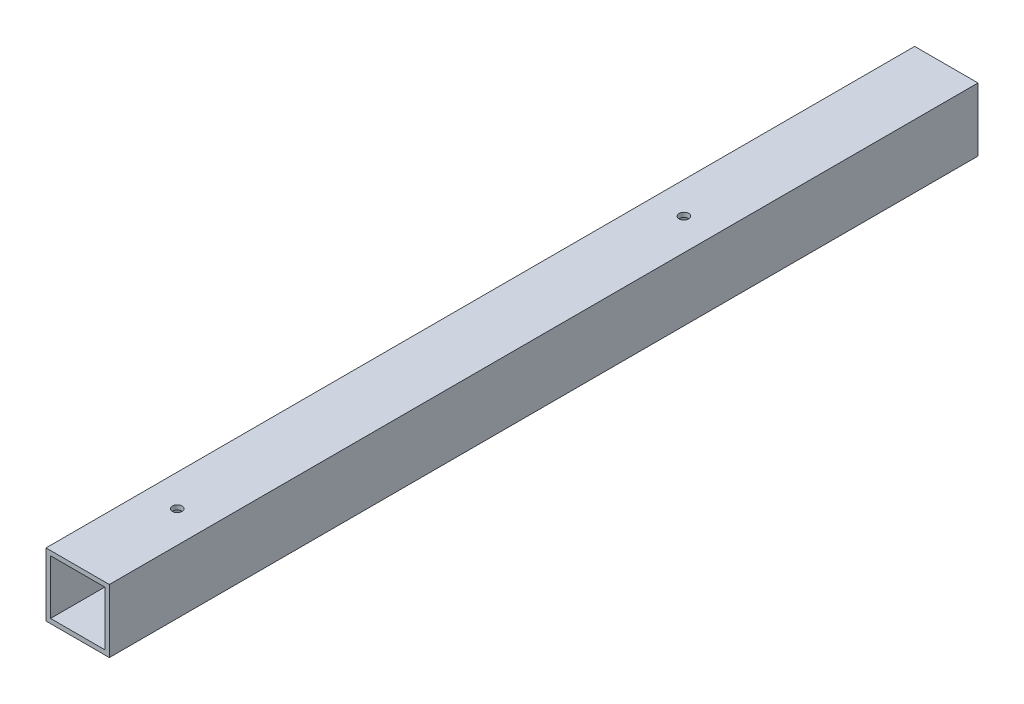
ISO-10303-21;
HEADER;
FILE_DESCRIPTION(('STEP AP214'),'2;1');
FILE_NAME('part.step','',(''),(''),'','','');
FILE_SCHEMA(('AUTOMOTIVE_DESIGN { 1 0 10303 214 1 1 1 1 }'));
ENDSEC;
DATA;
#1=APPLICATION_CONTEXT('core data for automotive mechanical design processes');
#2=APPLICATION_PROTOCOL_DEFINITION('international standard','automotive_design',2000,#1);
#3=PRODUCT_CONTEXT('',#1,'mechanical');
#4=PRODUCT('Part','Part','',(#3));
#5=PRODUCT_RELATED_PRODUCT_CATEGORY('part','',(#4));
#6=PRODUCT_DEFINITION_FORMATION('','',#4);
#7=PRODUCT_DEFINITION_CONTEXT('part definition',#1,'design');
#8=PRODUCT_DEFINITION('design','',#6,#7);
#9=PRODUCT_DEFINITION_SHAPE('','',#8);
#10=(LENGTH_UNIT() NAMED_UNIT(*) SI_UNIT(.MILLI.,.METRE.));
#11=(NAMED_UNIT(*) PLANE_ANGLE_UNIT() SI_UNIT($,.RADIAN.));
#12=(NAMED_UNIT(*) SI_UNIT($,.STERADIAN.) SOLID_ANGLE_UNIT());
#13=UNCERTAINTY_MEASURE_WITH_UNIT(LENGTH_MEASURE(1.E-05),#10,'distance_accuracy_value','');
#14=(GEOMETRIC_REPRESENTATION_CONTEXT(3) GLOBAL_UNCERTAINTY_ASSIGNED_CONTEXT((#13)) GLOBAL_UNIT_ASSIGNED_CONTEXT((#10,
#11,#12)) REPRESENTATION_CONTEXT('',''));
#15=CARTESIAN_POINT('',(0.,0.,0.));
#16=DIRECTION('',(0.,0.,1.));
#17=DIRECTION('',(1.,0.,0.));
#18=AXIS2_PLACEMENT_3D('',#15,#16,#17);
#19=CARTESIAN_POINT('',(0.,0.,609.6));
#20=DIRECTION('',(0.,0.,-1.));
#21=DIRECTION('',(-1.,0.,0.));
#22=AXIS2_PLACEMENT_3D('',#19,#20,#21);
#23=PLANE('',#22);
#24=DIRECTION('',(0.,-1.,0.));
#25=VECTOR('',#24,1.);
#26=CARTESIAN_POINT('',(0.,0.,609.6));
#27=LINE('',#26,#25);
#28=CARTESIAN_POINT('',(0.,44.45,609.6));
#29=VERTEX_POINT('',#28);
#30=CARTESIAN_POINT('',(0.,0.,609.6));
#31=VERTEX_POINT('',#30);
#32=EDGE_CURVE('E139',#29,#31,#27,.T.);
#33=ORIENTED_EDGE('',*,*,#32,.T.);
#34=DIRECTION('',(1.,0.,0.));
#35=VECTOR('',#34,1.);
#36=CARTESIAN_POINT('',(0.,0.,609.6));
#37=LINE('',#36,#35);
#38=CARTESIAN_POINT('',(44.45,0.,609.6));
#39=VERTEX_POINT('',#38);
#40=EDGE_CURVE('E142',#31,#39,#37,.T.);
#41=ORIENTED_EDGE('',*,*,#40,.T.);
#42=DIRECTION('',(0.,1.,0.));
#43=VECTOR('',#42,1.);
#44=CARTESIAN_POINT('',(44.45,0.,609.6));
#45=LINE('',#44,#43);
#46=CARTESIAN_POINT('',(44.45,44.45,609.6));
#47=VERTEX_POINT('',#46);
#48=EDGE_CURVE('E145',#39,#47,#45,.T.);
#49=ORIENTED_EDGE('',*,*,#48,.T.);
#50=DIRECTION('',(-1.,0.,0.));
#51=VECTOR('',#50,1.);
#52=CARTESIAN_POINT('',(0.,44.45,609.6));
#53=LINE('',#52,#51);
#54=EDGE_CURVE('E147',#47,#29,#53,.T.);
#55=ORIENTED_EDGE('',*,*,#54,.T.);
#56=EDGE_LOOP('',(#33,#41,#49,#55));
#57=FACE_BOUND('',#56,.T.);
#58=DIRECTION('',(1.,0.,0.));
#59=VECTOR('',#58,1.);
#60=CARTESIAN_POINT('',(3.175,3.175,609.6));
#61=LINE('',#60,#59);
#62=CARTESIAN_POINT('',(3.175,3.175,609.6));
#63=VERTEX_POINT('',#62);
#64=CARTESIAN_POINT('',(41.275,3.175,609.6));
#65=VERTEX_POINT('',#64);
#66=EDGE_CURVE('E101',#63,#65,#61,.T.);
#67=ORIENTED_EDGE('',*,*,#66,.F.);
#68=DIRECTION('',(0.,-1.,0.));
#69=VECTOR('',#68,1.);
#70=CARTESIAN_POINT('',(3.175,3.175,609.6));
#71=LINE('',#70,#69);
#72=CARTESIAN_POINT('',(3.175,41.275,609.6));
#73=VERTEX_POINT('',#72);
#74=EDGE_CURVE('E123',#73,#63,#71,.T.);
#75=ORIENTED_EDGE('',*,*,#74,.F.);
#76=DIRECTION('',(-1.,0.,0.));
#77=VECTOR('',#76,1.);
#78=CARTESIAN_POINT('',(3.175,41.275,609.6));
#79=LINE('',#78,#77);
#80=CARTESIAN_POINT('',(41.275,41.275,609.6));
#81=VERTEX_POINT('',#80);
#82=EDGE_CURVE('E121',#81,#73,#79,.T.);
#83=ORIENTED_EDGE('',*,*,#82,.F.);
#84=DIRECTION('',(0.,1.,0.));
#85=VECTOR('',#84,1.);
#86=CARTESIAN_POINT('',(41.275,3.175,609.6));
#87=LINE('',#86,#85);
#88=EDGE_CURVE('E109',#65,#81,#87,.T.);
#89=ORIENTED_EDGE('',*,*,#88,.F.);
#90=EDGE_LOOP('',(#67,#75,#83,#89));
#91=FACE_BOUND('',#90,.T.);
#92=ADVANCED_FACE('F34',(#57,#91),#23,.F.);
#93=CARTESIAN_POINT('',(0.,0.,0.));
#94=DIRECTION('',(0.,0.,-1.));
#95=DIRECTION('',(-1.,0.,0.));
#96=AXIS2_PLACEMENT_3D('',#93,#94,#95);
#97=PLANE('',#96);
#98=DIRECTION('',(0.,-1.,0.));
#99=VECTOR('',#98,1.);
#100=CARTESIAN_POINT('',(0.,0.,0.));
#101=LINE('',#100,#99);
#102=CARTESIAN_POINT('',(0.,44.45,0.));
#103=VERTEX_POINT('',#102);
#104=CARTESIAN_POINT('',(0.,0.,0.));
#105=VERTEX_POINT('',#104);
#106=EDGE_CURVE('E117',#103,#105,#101,.T.);
#107=ORIENTED_EDGE('',*,*,#106,.F.);
#108=DIRECTION('',(-1.,0.,0.));
#109=VECTOR('',#108,1.);
#110=CARTESIAN_POINT('',(0.,44.45,0.));
#111=LINE('',#110,#109);
#112=CARTESIAN_POINT('',(44.45,44.45,0.));
#113=VERTEX_POINT('',#112);
#114=EDGE_CURVE('E143',#113,#103,#111,.T.);
#115=ORIENTED_EDGE('',*,*,#114,.F.);
#116=DIRECTION('',(0.,1.,0.));
#117=VECTOR('',#116,1.);
#118=CARTESIAN_POINT('',(44.45,0.,0.));
#119=LINE('',#118,#117);
#120=CARTESIAN_POINT('',(44.45,0.,0.));
#121=VERTEX_POINT('',#120);
#122=EDGE_CURVE('E154',#121,#113,#119,.T.);
#123=ORIENTED_EDGE('',*,*,#122,.F.);
#124=DIRECTION('',(1.,0.,0.));
#125=VECTOR('',#124,1.);
#126=CARTESIAN_POINT('',(0.,0.,0.));
#127=LINE('',#126,#125);
#128=EDGE_CURVE('E152',#105,#121,#127,.T.);
#129=ORIENTED_EDGE('',*,*,#128,.F.);
#130=EDGE_LOOP('',(#107,#115,#123,#129));
#131=FACE_BOUND('',#130,.T.);
#132=DIRECTION('',(0.,-1.,0.));
#133=VECTOR('',#132,1.);
#134=CARTESIAN_POINT('',(3.175,3.175,0.));
#135=LINE('',#134,#133);
#136=CARTESIAN_POINT('',(3.175,41.275,0.));
#137=VERTEX_POINT('',#136);
#138=CARTESIAN_POINT('',(3.175,3.175,0.));
#139=VERTEX_POINT('',#138);
#140=EDGE_CURVE('E110',#137,#139,#135,.T.);
#141=ORIENTED_EDGE('',*,*,#140,.T.);
#142=DIRECTION('',(1.,0.,0.));
#143=VECTOR('',#142,1.);
#144=CARTESIAN_POINT('',(3.175,3.175,0.));
#145=LINE('',#144,#143);
#146=CARTESIAN_POINT('',(41.275,3.175,0.));
#147=VERTEX_POINT('',#146);
#148=EDGE_CURVE('E59',#139,#147,#145,.T.);
#149=ORIENTED_EDGE('',*,*,#148,.T.);
#150=DIRECTION('',(0.,1.,0.));
#151=VECTOR('',#150,1.);
#152=CARTESIAN_POINT('',(41.275,3.175,0.));
#153=LINE('',#152,#151);
#154=CARTESIAN_POINT('',(41.275,41.275,0.));
#155=VERTEX_POINT('',#154);
#156=EDGE_CURVE('E116',#147,#155,#153,.T.);
#157=ORIENTED_EDGE('',*,*,#156,.T.);
#158=DIRECTION('',(-1.,0.,0.));
#159=VECTOR('',#158,1.);
#160=CARTESIAN_POINT('',(3.175,41.275,0.));
#161=LINE('',#160,#159);
#162=EDGE_CURVE('E131',#155,#137,#161,.T.);
#163=ORIENTED_EDGE('',*,*,#162,.T.);
#164=EDGE_LOOP('',(#141,#149,#157,#163));
#165=FACE_BOUND('',#164,.T.);
#166=ADVANCED_FACE('F206',(#131,#165),#97,.T.);
#167=CARTESIAN_POINT('',(0.,0.,609.6));
#168=DIRECTION('',(1.,0.,0.));
#169=DIRECTION('',(0.,0.,-1.));
#170=AXIS2_PLACEMENT_3D('',#167,#168,#169);
#171=PLANE('',#170);
#172=ORIENTED_EDGE('',*,*,#106,.T.);
#173=DIRECTION('',(0.,0.,-1.));
#174=VECTOR('',#173,1.);
#175=CARTESIAN_POINT('',(0.,0.,609.6));
#176=LINE('',#175,#174);
#177=EDGE_CURVE('E11',#31,#105,#176,.T.);
#178=ORIENTED_EDGE('',*,*,#177,.F.);
#179=ORIENTED_EDGE('',*,*,#32,.F.);
#180=DIRECTION('',(0.,0.,-1.));
#181=VECTOR('',#180,1.);
#182=CARTESIAN_POINT('',(0.,44.45,609.6));
#183=LINE('',#182,#181);
#184=EDGE_CURVE('E149',#29,#103,#183,.T.);
#185=ORIENTED_EDGE('',*,*,#184,.T.);
#186=EDGE_LOOP('',(#172,#178,#179,#185));
#187=FACE_BOUND('',#186,.T.);
#188=ADVANCED_FACE('F36',(#187),#171,.F.);
#189=CARTESIAN_POINT('',(0.,0.,609.6));
#190=DIRECTION('',(0.,1.,0.));
#191=DIRECTION('',(0.,0.,1.));
#192=AXIS2_PLACEMENT_3D('',#189,#190,#191);
#193=PLANE('',#192);
#194=CARTESIAN_POINT('',(22.225,0.,539.75));
#195=DIRECTION('',(0.,1.,0.));
#196=DIRECTION('',(0.,0.,1.));
#197=AXIS2_PLACEMENT_3D('',#194,#195,#196);
#198=CIRCLE('',#197,3.37819999999999);
#199=CARTESIAN_POINT('',(22.225,0.,543.1282));
#200=VERTEX_POINT('',#199);
#201=EDGE_CURVE('E180',#200,#200,#198,.T.);
#202=ORIENTED_EDGE('',*,*,#201,.T.);
#203=EDGE_LOOP('',(#202));
#204=FACE_BOUND('',#203,.T.);
#205=CARTESIAN_POINT('',(22.225,0.,184.15));
#206=DIRECTION('',(0.,1.,0.));
#207=DIRECTION('',(0.,0.,1.));
#208=AXIS2_PLACEMENT_3D('',#205,#206,#207);
#209=CIRCLE('',#208,3.37819999999999);
#210=CARTESIAN_POINT('',(22.225,0.,187.5282));
#211=VERTEX_POINT('',#210);
#212=EDGE_CURVE('E165',#211,#211,#209,.T.);
#213=ORIENTED_EDGE('',*,*,#212,.T.);
#214=EDGE_LOOP('',(#213));
#215=FACE_BOUND('',#214,.T.);
#216=ORIENTED_EDGE('',*,*,#128,.T.);
#217=DIRECTION('',(0.,0.,-1.));
#218=VECTOR('',#217,1.);
#219=CARTESIAN_POINT('',(44.45,0.,609.6));
#220=LINE('',#219,#218);
#221=EDGE_CURVE('E43',#39,#121,#220,.T.);
#222=ORIENTED_EDGE('',*,*,#221,.F.);
#223=ORIENTED_EDGE('',*,*,#40,.F.);
#224=ORIENTED_EDGE('',*,*,#177,.T.);
#225=EDGE_LOOP('',(#216,#222,#223,#224));
#226=FACE_BOUND('',#225,.T.);
#227=ADVANCED_FACE('F210',(#204,#215,#226),#193,.F.);
#228=CARTESIAN_POINT('',(44.45,0.,609.6));
#229=DIRECTION('',(-1.,0.,0.));
#230=DIRECTION('',(0.,0.,1.));
#231=AXIS2_PLACEMENT_3D('',#228,#229,#230);
#232=PLANE('',#231);
#233=ORIENTED_EDGE('',*,*,#122,.T.);
#234=DIRECTION('',(0.,0.,-1.));
#235=VECTOR('',#234,1.);
#236=CARTESIAN_POINT('',(44.45,44.45,609.6));
#237=LINE('',#236,#235);
#238=EDGE_CURVE('E159',#47,#113,#237,.T.);
#239=ORIENTED_EDGE('',*,*,#238,.F.);
#240=ORIENTED_EDGE('',*,*,#48,.F.);
#241=ORIENTED_EDGE('',*,*,#221,.T.);
#242=EDGE_LOOP('',(#233,#239,#240,#241));
#243=FACE_BOUND('',#242,.T.);
#244=ADVANCED_FACE('F192',(#243),#232,.F.);
#245=CARTESIAN_POINT('',(0.,44.45,609.6));
#246=DIRECTION('',(0.,-1.,0.));
#247=DIRECTION('',(0.,0.,-1.));
#248=AXIS2_PLACEMENT_3D('',#245,#246,#247);
#249=PLANE('',#248);
#250=CARTESIAN_POINT('',(22.225,44.45,539.75));
#251=DIRECTION('',(0.,1.,0.));
#252=DIRECTION('',(0.,0.,1.));
#253=AXIS2_PLACEMENT_3D('',#250,#251,#252);
#254=CIRCLE('',#253,3.37819999999999);
#255=CARTESIAN_POINT('',(22.225,44.45,543.1282));
#256=VERTEX_POINT('',#255);
#257=EDGE_CURVE('E183',#256,#256,#254,.T.);
#258=ORIENTED_EDGE('',*,*,#257,.F.);
#259=EDGE_LOOP('',(#258));
#260=FACE_BOUND('',#259,.T.);
#261=CARTESIAN_POINT('',(22.225,44.45,184.15));
#262=DIRECTION('',(0.,1.,0.));
#263=DIRECTION('',(0.,0.,1.));
#264=AXIS2_PLACEMENT_3D('',#261,#262,#263);
#265=CIRCLE('',#264,3.37819999999999);
#266=CARTESIAN_POINT('',(22.225,44.45,187.5282));
#267=VERTEX_POINT('',#266);
#268=EDGE_CURVE('E170',#267,#267,#265,.T.);
#269=ORIENTED_EDGE('',*,*,#268,.F.);
#270=EDGE_LOOP('',(#269));
#271=FACE_BOUND('',#270,.T.);
#272=ORIENTED_EDGE('',*,*,#114,.T.);
#273=ORIENTED_EDGE('',*,*,#184,.F.);
#274=ORIENTED_EDGE('',*,*,#54,.F.);
#275=ORIENTED_EDGE('',*,*,#238,.T.);
#276=EDGE_LOOP('',(#272,#273,#274,#275));
#277=FACE_BOUND('',#276,.T.);
#278=ADVANCED_FACE('F189',(#260,#271,#277),#249,.F.);
#279=CARTESIAN_POINT('',(3.175,3.175,609.6));
#280=DIRECTION('',(0.,1.,0.));
#281=DIRECTION('',(0.,0.,1.));
#282=AXIS2_PLACEMENT_3D('',#279,#280,#281);
#283=PLANE('',#282);
#284=CARTESIAN_POINT('',(22.225,3.175,539.75));
#285=DIRECTION('',(0.,1.,0.));
#286=DIRECTION('',(0.,0.,1.));
#287=AXIS2_PLACEMENT_3D('',#284,#285,#286);
#288=CIRCLE('',#287,3.37819999999999);
#289=CARTESIAN_POINT('',(22.225,3.175,543.1282));
#290=VERTEX_POINT('',#289);
#291=EDGE_CURVE('E175',#290,#290,#288,.T.);
#292=ORIENTED_EDGE('',*,*,#291,.F.);
#293=EDGE_LOOP('',(#292));
#294=FACE_BOUND('',#293,.T.);
#295=CARTESIAN_POINT('',(22.225,3.175,184.15));
#296=DIRECTION('',(0.,1.,0.));
#297=DIRECTION('',(0.,0.,1.));
#298=AXIS2_PLACEMENT_3D('',#295,#296,#297);
#299=CIRCLE('',#298,3.37819999999999);
#300=CARTESIAN_POINT('',(22.225,3.175,187.5282));
#301=VERTEX_POINT('',#300);
#302=EDGE_CURVE('E163',#301,#301,#299,.T.);
#303=ORIENTED_EDGE('',*,*,#302,.F.);
#304=EDGE_LOOP('',(#303));
#305=FACE_BOUND('',#304,.T.);
#306=ORIENTED_EDGE('',*,*,#148,.F.);
#307=DIRECTION('',(0.,0.,-1.));
#308=VECTOR('',#307,1.);
#309=CARTESIAN_POINT('',(3.175,3.175,609.6));
#310=LINE('',#309,#308);
#311=EDGE_CURVE('E105',#63,#139,#310,.T.);
#312=ORIENTED_EDGE('',*,*,#311,.F.);
#313=ORIENTED_EDGE('',*,*,#66,.T.);
#314=DIRECTION('',(0.,0.,-1.));
#315=VECTOR('',#314,1.);
#316=CARTESIAN_POINT('',(41.275,3.175,609.6));
#317=LINE('',#316,#315);
#318=EDGE_CURVE('E104',#65,#147,#317,.T.);
#319=ORIENTED_EDGE('',*,*,#318,.T.);
#320=EDGE_LOOP('',(#306,#312,#313,#319));
#321=FACE_BOUND('',#320,.T.);
#322=ADVANCED_FACE('F103',(#294,#305,#321),#283,.T.);
#323=CARTESIAN_POINT('',(41.275,3.175,609.6));
#324=DIRECTION('',(-1.,0.,0.));
#325=DIRECTION('',(0.,0.,1.));
#326=AXIS2_PLACEMENT_3D('',#323,#324,#325);
#327=PLANE('',#326);
#328=ORIENTED_EDGE('',*,*,#156,.F.);
#329=ORIENTED_EDGE('',*,*,#318,.F.);
#330=ORIENTED_EDGE('',*,*,#88,.T.);
#331=DIRECTION('',(0.,0.,-1.));
#332=VECTOR('',#331,1.);
#333=CARTESIAN_POINT('',(41.275,41.275,609.6));
#334=LINE('',#333,#332);
#335=EDGE_CURVE('E118',#81,#155,#334,.T.);
#336=ORIENTED_EDGE('',*,*,#335,.T.);
#337=EDGE_LOOP('',(#328,#329,#330,#336));
#338=FACE_BOUND('',#337,.T.);
#339=ADVANCED_FACE('F113',(#338),#327,.T.);
#340=CARTESIAN_POINT('',(3.175,41.275,609.6));
#341=DIRECTION('',(0.,-1.,0.));
#342=DIRECTION('',(0.,0.,-1.));
#343=AXIS2_PLACEMENT_3D('',#340,#341,#342);
#344=PLANE('',#343);
#345=CARTESIAN_POINT('',(22.225,41.275,539.75));
#346=DIRECTION('',(0.,-1.,0.));
#347=DIRECTION('',(0.,0.,-1.));
#348=AXIS2_PLACEMENT_3D('',#345,#346,#347);
#349=CIRCLE('',#348,3.37819999999999);
#350=CARTESIAN_POINT('',(22.225,41.275,536.3718));
#351=VERTEX_POINT('',#350);
#352=EDGE_CURVE('E38',#351,#351,#349,.T.);
#353=ORIENTED_EDGE('',*,*,#352,.F.);
#354=EDGE_LOOP('',(#353));
#355=FACE_BOUND('',#354,.T.);
#356=CARTESIAN_POINT('',(22.225,41.275,184.15));
#357=DIRECTION('',(0.,-1.,0.));
#358=DIRECTION('',(0.,0.,-1.));
#359=AXIS2_PLACEMENT_3D('',#356,#357,#358);
#360=CIRCLE('',#359,3.37819999999999);
#361=CARTESIAN_POINT('',(22.225,41.275,180.7718));
#362=VERTEX_POINT('',#361);
#363=EDGE_CURVE('E129',#362,#362,#360,.T.);
#364=ORIENTED_EDGE('',*,*,#363,.F.);
#365=EDGE_LOOP('',(#364));
#366=FACE_BOUND('',#365,.T.);
#367=ORIENTED_EDGE('',*,*,#162,.F.);
#368=ORIENTED_EDGE('',*,*,#335,.F.);
#369=ORIENTED_EDGE('',*,*,#82,.T.);
#370=DIRECTION('',(0.,0.,-1.));
#371=VECTOR('',#370,1.);
#372=CARTESIAN_POINT('',(3.175,41.275,609.6));
#373=LINE('',#372,#371);
#374=EDGE_CURVE('E51',#73,#137,#373,.T.);
#375=ORIENTED_EDGE('',*,*,#374,.T.);
#376=EDGE_LOOP('',(#367,#368,#369,#375));
#377=FACE_BOUND('',#376,.T.);
#378=ADVANCED_FACE('F232',(#355,#366,#377),#344,.T.);
#379=CARTESIAN_POINT('',(3.175,3.175,609.6));
#380=DIRECTION('',(1.,0.,0.));
#381=DIRECTION('',(0.,0.,-1.));
#382=AXIS2_PLACEMENT_3D('',#379,#380,#381);
#383=PLANE('',#382);
#384=ORIENTED_EDGE('',*,*,#140,.F.);
#385=ORIENTED_EDGE('',*,*,#374,.F.);
#386=ORIENTED_EDGE('',*,*,#74,.T.);
#387=ORIENTED_EDGE('',*,*,#311,.T.);
#388=EDGE_LOOP('',(#384,#385,#386,#387));
#389=FACE_BOUND('',#388,.T.);
#390=ADVANCED_FACE('F235',(#389),#383,.T.);
#391=CARTESIAN_POINT('',(22.225,44.45,184.15));
#392=DIRECTION('',(0.,1.,0.));
#393=DIRECTION('',(0.,0.,1.));
#394=AXIS2_PLACEMENT_3D('',#391,#392,#393);
#395=CYLINDRICAL_SURFACE('',#394,3.37819999999999);
#396=ORIENTED_EDGE('',*,*,#302,.T.);
#397=EDGE_LOOP('',(#396));
#398=FACE_BOUND('',#397,.T.);
#399=ORIENTED_EDGE('',*,*,#212,.F.);
#400=EDGE_LOOP('',(#399));
#401=FACE_BOUND('',#400,.T.);
#402=ADVANCED_FACE('F239',(#398,#401),#395,.F.);
#403=ORIENTED_EDGE('',*,*,#363,.T.);
#404=EDGE_LOOP('',(#403));
#405=FACE_BOUND('',#404,.T.);
#406=ORIENTED_EDGE('',*,*,#268,.T.);
#407=EDGE_LOOP('',(#406));
#408=FACE_BOUND('',#407,.T.);
#409=ADVANCED_FACE('F242',(#405,#408),#395,.F.);
#410=CARTESIAN_POINT('',(22.225,44.45,539.75));
#411=DIRECTION('',(0.,1.,0.));
#412=DIRECTION('',(0.,0.,1.));
#413=AXIS2_PLACEMENT_3D('',#410,#411,#412);
#414=CYLINDRICAL_SURFACE('',#413,3.37819999999999);
#415=ORIENTED_EDGE('',*,*,#352,.T.);
#416=EDGE_LOOP('',(#415));
#417=FACE_BOUND('',#416,.T.);
#418=ORIENTED_EDGE('',*,*,#257,.T.);
#419=EDGE_LOOP('',(#418));
#420=FACE_BOUND('',#419,.T.);
#421=ADVANCED_FACE('F187',(#417,#420),#414,.F.);
#422=ORIENTED_EDGE('',*,*,#291,.T.);
#423=EDGE_LOOP('',(#422));
#424=FACE_BOUND('',#423,.T.);
#425=ORIENTED_EDGE('',*,*,#201,.F.);
#426=EDGE_LOOP('',(#425));
#427=FACE_BOUND('',#426,.T.);
#428=ADVANCED_FACE('F244',(#424,#427),#414,.F.);
#429=CLOSED_SHELL('',(#92,#166,#188,#227,#244,#278,#322,#339,#378,#390,#402,#409,#421,#428));
#430=MANIFOLD_SOLID_BREP('B2',#429);
#431=ADVANCED_BREP_SHAPE_REPRESENTATION('',(#18,#430),#14);
#432=SHAPE_DEFINITION_REPRESENTATION(#9,#431);
ENDSEC;
END-ISO-10303-21;
